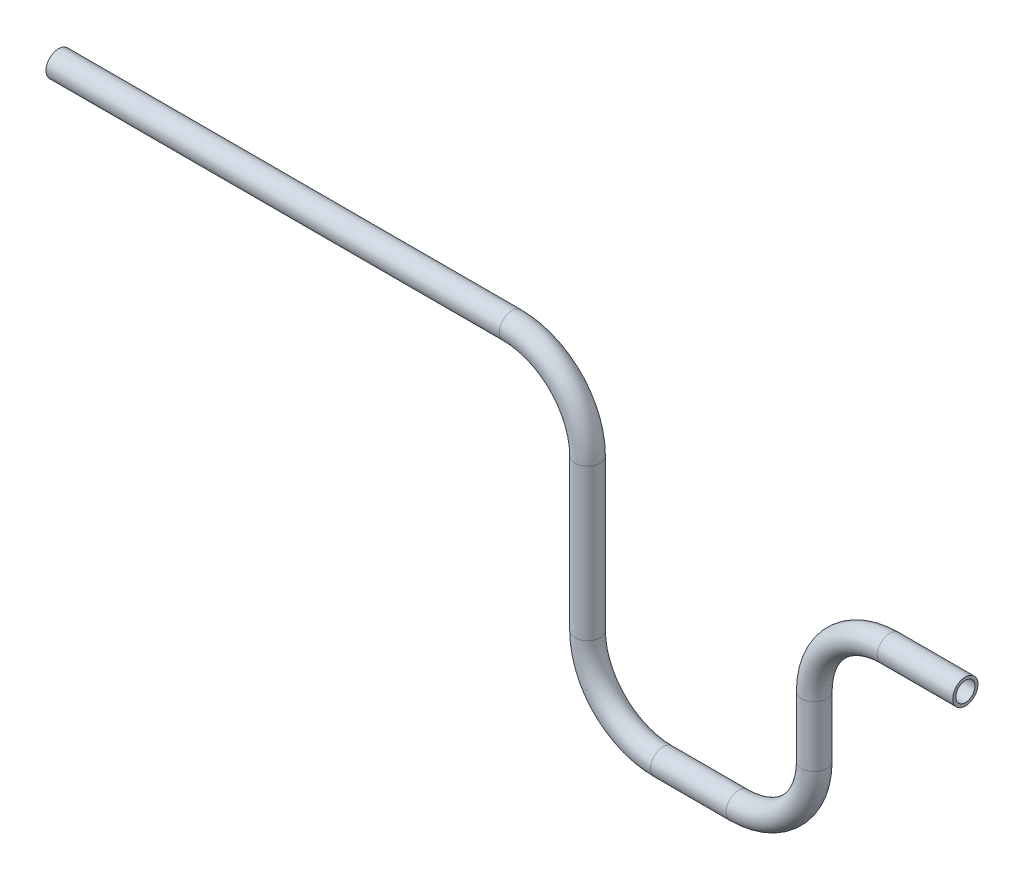
ISO-10303-21;
HEADER;
FILE_DESCRIPTION(('STEP AP214'),'2;1');
FILE_NAME('part.step','',(''),(''),'','','');
FILE_SCHEMA(('AUTOMOTIVE_DESIGN { 1 0 10303 214 1 1 1 1 }'));
ENDSEC;
DATA;
#1=APPLICATION_CONTEXT('core data for automotive mechanical design processes');
#2=APPLICATION_PROTOCOL_DEFINITION('international standard','automotive_design',2000,#1);
#3=PRODUCT_CONTEXT('',#1,'mechanical');
#4=PRODUCT('Part','Part','',(#3));
#5=PRODUCT_RELATED_PRODUCT_CATEGORY('part','',(#4));
#6=PRODUCT_DEFINITION_FORMATION('','',#4);
#7=PRODUCT_DEFINITION_CONTEXT('part definition',#1,'design');
#8=PRODUCT_DEFINITION('design','',#6,#7);
#9=PRODUCT_DEFINITION_SHAPE('','',#8);
#10=(LENGTH_UNIT() NAMED_UNIT(*) SI_UNIT(.MILLI.,.METRE.));
#11=(NAMED_UNIT(*) PLANE_ANGLE_UNIT() SI_UNIT($,.RADIAN.));
#12=(NAMED_UNIT(*) SI_UNIT($,.STERADIAN.) SOLID_ANGLE_UNIT());
#13=UNCERTAINTY_MEASURE_WITH_UNIT(LENGTH_MEASURE(1.E-05),#10,'distance_accuracy_value','');
#14=(GEOMETRIC_REPRESENTATION_CONTEXT(3) GLOBAL_UNCERTAINTY_ASSIGNED_CONTEXT((#13)) GLOBAL_UNIT_ASSIGNED_CONTEXT((#10,
#11,#12)) REPRESENTATION_CONTEXT('',''));
#15=CARTESIAN_POINT('',(0.,0.,0.));
#16=DIRECTION('',(0.,0.,1.));
#17=DIRECTION('',(1.,0.,0.));
#18=AXIS2_PLACEMENT_3D('',#15,#16,#17);
#19=CARTESIAN_POINT('',(550.,-59.9999999999998,0.));
#20=DIRECTION('',(1.,0.,0.));
#21=DIRECTION('',(0.,1.,0.));
#22=AXIS2_PLACEMENT_3D('',#19,#20,#21);
#23=CYLINDRICAL_SURFACE('',#22,8.35);
#24=CARTESIAN_POINT('',(550.,-59.9999999999998,0.));
#25=DIRECTION('',(1.,0.,0.));
#26=DIRECTION('',(0.,0.,-1.));
#27=AXIS2_PLACEMENT_3D('',#24,#25,#26);
#28=CIRCLE('',#27,8.35);
#29=CARTESIAN_POINT('',(550.,-51.6499999999999,0.));
#30=VERTEX_POINT('',#29);
#31=EDGE_CURVE('E41',#30,#30,#28,.T.);
#32=ORIENTED_EDGE('',*,*,#31,.T.);
#33=EDGE_LOOP('',(#32));
#34=FACE_BOUND('',#33,.T.);
#35=CARTESIAN_POINT('',(600.,-59.9999999999999,0.));
#36=DIRECTION('',(1.,0.,0.));
#37=DIRECTION('',(0.,0.,-1.));
#38=AXIS2_PLACEMENT_3D('',#35,#36,#37);
#39=CIRCLE('',#38,8.35);
#40=CARTESIAN_POINT('',(600.,-59.9999999999999,-8.35));
#41=VERTEX_POINT('',#40);
#42=EDGE_CURVE('E10',#41,#41,#39,.T.);
#43=ORIENTED_EDGE('',*,*,#42,.F.);
#44=EDGE_LOOP('',(#43));
#45=FACE_BOUND('',#44,.T.);
#46=ADVANCED_FACE('F35',(#34,#45),#23,.T.);
#47=CARTESIAN_POINT('',(550.,-110.,0.));
#48=DIRECTION('',(0.,0.,-1.));
#49=DIRECTION('',(-1.,0.,0.));
#50=AXIS2_PLACEMENT_3D('',#47,#48,#49);
#51=TOROIDAL_SURFACE('',#50,50.0000000000002,8.35);
#52=CARTESIAN_POINT('',(500.,-110.,0.));
#53=DIRECTION('',(0.,1.,0.));
#54=DIRECTION('',(0.,0.,-1.));
#55=AXIS2_PLACEMENT_3D('',#52,#53,#54);
#56=CIRCLE('',#55,8.35);
#57=CARTESIAN_POINT('',(491.65,-110.,0.));
#58=VERTEX_POINT('',#57);
#59=EDGE_CURVE('E45',#58,#58,#56,.T.);
#60=CARTESIAN_POINT('',(550.,-110.,0.));
#61=DIRECTION('',(0.,0.,-1.));
#62=DIRECTION('',(-1.,0.,0.));
#63=AXIS2_PLACEMENT_3D('',#60,#61,#62);
#64=CIRCLE('',#63,58.3500000000002);
#65=EDGE_CURVE('',#58,#30,#64,.T.);
#66=ORIENTED_EDGE('',*,*,#59,.T.);
#67=ORIENTED_EDGE('',*,*,#31,.F.);
#68=ORIENTED_EDGE('',*,*,#65,.T.);
#69=ORIENTED_EDGE('',*,*,#65,.F.);
#70=EDGE_LOOP('',(#66,#68,#67,#69));
#71=FACE_BOUND('',#70,.T.);
#72=ADVANCED_FACE('F127',(#71),#51,.T.);
#73=CARTESIAN_POINT('',(500.,-150.,0.));
#74=DIRECTION('',(0.,1.,0.));
#75=DIRECTION('',(0.,0.,1.));
#76=AXIS2_PLACEMENT_3D('',#73,#74,#75);
#77=CYLINDRICAL_SURFACE('',#76,8.35);
#78=CARTESIAN_POINT('',(500.,-150.,0.));
#79=DIRECTION('',(0.,1.,0.));
#80=DIRECTION('',(0.,0.,-1.));
#81=AXIS2_PLACEMENT_3D('',#78,#79,#80);
#82=CIRCLE('',#81,8.35);
#83=CARTESIAN_POINT('',(508.35,-150.,0.));
#84=VERTEX_POINT('',#83);
#85=EDGE_CURVE('E49',#84,#84,#82,.T.);
#86=ORIENTED_EDGE('',*,*,#85,.T.);
#87=EDGE_LOOP('',(#86));
#88=FACE_BOUND('',#87,.T.);
#89=ORIENTED_EDGE('',*,*,#59,.F.);
#90=EDGE_LOOP('',(#89));
#91=FACE_BOUND('',#90,.T.);
#92=ADVANCED_FACE('F131',(#88,#91),#77,.T.);
#93=CARTESIAN_POINT('',(450.,-150.,0.));
#94=DIRECTION('',(0.,0.,1.));
#95=DIRECTION('',(1.,0.,0.));
#96=AXIS2_PLACEMENT_3D('',#93,#94,#95);
#97=TOROIDAL_SURFACE('',#96,50.,8.35);
#98=CARTESIAN_POINT('',(450.,-200.,0.));
#99=DIRECTION('',(1.,0.,0.));
#100=DIRECTION('',(0.,0.,-1.));
#101=AXIS2_PLACEMENT_3D('',#98,#99,#100);
#102=CIRCLE('',#101,8.35);
#103=CARTESIAN_POINT('',(450.,-208.35,0.));
#104=VERTEX_POINT('',#103);
#105=EDGE_CURVE('E54',#104,#104,#102,.T.);
#106=CARTESIAN_POINT('',(450.,-150.,0.));
#107=DIRECTION('',(0.,0.,1.));
#108=DIRECTION('',(1.,0.,0.));
#109=AXIS2_PLACEMENT_3D('',#106,#107,#108);
#110=CIRCLE('',#109,58.35);
#111=EDGE_CURVE('',#104,#84,#110,.T.);
#112=ORIENTED_EDGE('',*,*,#105,.T.);
#113=ORIENTED_EDGE('',*,*,#85,.F.);
#114=ORIENTED_EDGE('',*,*,#111,.T.);
#115=ORIENTED_EDGE('',*,*,#111,.F.);
#116=EDGE_LOOP('',(#112,#114,#113,#115));
#117=FACE_BOUND('',#116,.T.);
#118=ADVANCED_FACE('F137',(#117),#97,.T.);
#119=CARTESIAN_POINT('',(400.,-200.,0.));
#120=DIRECTION('',(1.,0.,0.));
#121=DIRECTION('',(0.,0.,-1.));
#122=AXIS2_PLACEMENT_3D('',#119,#120,#121);
#123=CYLINDRICAL_SURFACE('',#122,8.35);
#124=CARTESIAN_POINT('',(400.,-200.,0.));
#125=DIRECTION('',(1.,0.,0.));
#126=DIRECTION('',(0.,0.,-1.));
#127=AXIS2_PLACEMENT_3D('',#124,#125,#126);
#128=CIRCLE('',#127,8.35);
#129=CARTESIAN_POINT('',(400.,-208.35,0.));
#130=VERTEX_POINT('',#129);
#131=EDGE_CURVE('E57',#130,#130,#128,.T.);
#132=ORIENTED_EDGE('',*,*,#131,.T.);
#133=EDGE_LOOP('',(#132));
#134=FACE_BOUND('',#133,.T.);
#135=ORIENTED_EDGE('',*,*,#105,.F.);
#136=EDGE_LOOP('',(#135));
#137=FACE_BOUND('',#136,.T.);
#138=ADVANCED_FACE('F144',(#134,#137),#123,.T.);
#139=CARTESIAN_POINT('',(400.,-150.,0.));
#140=DIRECTION('',(0.,0.,1.));
#141=DIRECTION('',(1.,0.,0.));
#142=AXIS2_PLACEMENT_3D('',#139,#140,#141);
#143=TOROIDAL_SURFACE('',#142,50.,8.35);
#144=CARTESIAN_POINT('',(350.,-150.,0.));
#145=DIRECTION('',(0.,-1.,0.));
#146=DIRECTION('',(0.,0.,-1.));
#147=AXIS2_PLACEMENT_3D('',#144,#145,#146);
#148=CIRCLE('',#147,8.35);
#149=CARTESIAN_POINT('',(341.65,-150.,0.));
#150=VERTEX_POINT('',#149);
#151=EDGE_CURVE('E60',#150,#150,#148,.T.);
#152=CARTESIAN_POINT('',(400.,-150.,0.));
#153=DIRECTION('',(0.,0.,1.));
#154=DIRECTION('',(1.,0.,0.));
#155=AXIS2_PLACEMENT_3D('',#152,#153,#154);
#156=CIRCLE('',#155,58.35);
#157=EDGE_CURVE('',#150,#130,#156,.T.);
#158=ORIENTED_EDGE('',*,*,#151,.T.);
#159=ORIENTED_EDGE('',*,*,#131,.F.);
#160=ORIENTED_EDGE('',*,*,#157,.T.);
#161=ORIENTED_EDGE('',*,*,#157,.F.);
#162=EDGE_LOOP('',(#158,#160,#159,#161));
#163=FACE_BOUND('',#162,.T.);
#164=ADVANCED_FACE('F148',(#163),#143,.T.);
#165=CARTESIAN_POINT('',(350.,-50.,0.));
#166=DIRECTION('',(0.,-1.,0.));
#167=DIRECTION('',(0.,0.,-1.));
#168=AXIS2_PLACEMENT_3D('',#165,#166,#167);
#169=CYLINDRICAL_SURFACE('',#168,8.35);
#170=CARTESIAN_POINT('',(350.,-50.,0.));
#171=DIRECTION('',(0.,-1.,0.));
#172=DIRECTION('',(0.,0.,-1.));
#173=AXIS2_PLACEMENT_3D('',#170,#171,#172);
#174=CIRCLE('',#173,8.35);
#175=CARTESIAN_POINT('',(358.35,-50.,0.));
#176=VERTEX_POINT('',#175);
#177=EDGE_CURVE('E63',#176,#176,#174,.T.);
#178=ORIENTED_EDGE('',*,*,#177,.T.);
#179=EDGE_LOOP('',(#178));
#180=FACE_BOUND('',#179,.T.);
#181=ORIENTED_EDGE('',*,*,#151,.F.);
#182=EDGE_LOOP('',(#181));
#183=FACE_BOUND('',#182,.T.);
#184=ADVANCED_FACE('F152',(#180,#183),#169,.T.);
#185=CARTESIAN_POINT('',(300.,-50.,0.));
#186=DIRECTION('',(0.,0.,-1.));
#187=DIRECTION('',(-1.,0.,0.));
#188=AXIS2_PLACEMENT_3D('',#185,#186,#187);
#189=TOROIDAL_SURFACE('',#188,50.,8.35);
#190=CARTESIAN_POINT('',(300.,0.,0.));
#191=DIRECTION('',(1.,0.,0.));
#192=DIRECTION('',(0.,0.,-1.));
#193=AXIS2_PLACEMENT_3D('',#190,#191,#192);
#194=CIRCLE('',#193,8.35);
#195=CARTESIAN_POINT('',(300.,8.35,0.));
#196=VERTEX_POINT('',#195);
#197=EDGE_CURVE('E66',#196,#196,#194,.T.);
#198=CARTESIAN_POINT('',(300.,-50.,0.));
#199=DIRECTION('',(0.,0.,-1.));
#200=DIRECTION('',(-1.,0.,0.));
#201=AXIS2_PLACEMENT_3D('',#198,#199,#200);
#202=CIRCLE('',#201,58.35);
#203=EDGE_CURVE('',#196,#176,#202,.T.);
#204=ORIENTED_EDGE('',*,*,#197,.T.);
#205=ORIENTED_EDGE('',*,*,#177,.F.);
#206=ORIENTED_EDGE('',*,*,#203,.T.);
#207=ORIENTED_EDGE('',*,*,#203,.F.);
#208=EDGE_LOOP('',(#204,#206,#205,#207));
#209=FACE_BOUND('',#208,.T.);
#210=ADVANCED_FACE('F122',(#209),#189,.T.);
#211=CARTESIAN_POINT('',(300.,0.,0.));
#212=DIRECTION('',(-1.,0.,0.));
#213=DIRECTION('',(0.,0.,1.));
#214=AXIS2_PLACEMENT_3D('',#211,#212,#213);
#215=CYLINDRICAL_SURFACE('',#214,8.35);
#216=ORIENTED_EDGE('',*,*,#197,.F.);
#217=EDGE_LOOP('',(#216));
#218=FACE_BOUND('',#217,.T.);
#219=CARTESIAN_POINT('',(0.,0.,0.));
#220=DIRECTION('',(1.,0.,0.));
#221=DIRECTION('',(0.,0.,-1.));
#222=AXIS2_PLACEMENT_3D('',#219,#220,#221);
#223=CIRCLE('',#222,8.35);
#224=CARTESIAN_POINT('',(0.,0.,-8.35));
#225=VERTEX_POINT('',#224);
#226=EDGE_CURVE('E67',#225,#225,#223,.T.);
#227=ORIENTED_EDGE('',*,*,#226,.T.);
#228=EDGE_LOOP('',(#227));
#229=FACE_BOUND('',#228,.T.);
#230=ADVANCED_FACE('F114',(#218,#229),#215,.T.);
#231=CARTESIAN_POINT('',(600.,-59.9999999999999,0.));
#232=DIRECTION('',(1.,0.,0.));
#233=DIRECTION('',(0.,0.,-1.));
#234=AXIS2_PLACEMENT_3D('',#231,#232,#233);
#235=PLANE('',#234);
#236=CARTESIAN_POINT('',(600.,-59.9999999999999,0.));
#237=DIRECTION('',(1.,0.,0.));
#238=DIRECTION('',(0.,0.,-1.));
#239=AXIS2_PLACEMENT_3D('',#236,#237,#238);
#240=CIRCLE('',#239,6.35);
#241=CARTESIAN_POINT('',(600.,-59.9999999999999,-6.35));
#242=VERTEX_POINT('',#241);
#243=EDGE_CURVE('E70',#242,#242,#240,.T.);
#244=ORIENTED_EDGE('',*,*,#243,.F.);
#245=EDGE_LOOP('',(#244));
#246=FACE_BOUND('',#245,.T.);
#247=ORIENTED_EDGE('',*,*,#42,.T.);
#248=EDGE_LOOP('',(#247));
#249=FACE_BOUND('',#248,.T.);
#250=ADVANCED_FACE('F112',(#246,#249),#235,.T.);
#251=CARTESIAN_POINT('',(0.,0.,0.));
#252=DIRECTION('',(1.,0.,0.));
#253=DIRECTION('',(0.,0.,-1.));
#254=AXIS2_PLACEMENT_3D('',#251,#252,#253);
#255=PLANE('',#254);
#256=CARTESIAN_POINT('',(0.,0.,0.));
#257=DIRECTION('',(1.,0.,0.));
#258=DIRECTION('',(0.,0.,-1.));
#259=AXIS2_PLACEMENT_3D('',#256,#257,#258);
#260=CIRCLE('',#259,6.35);
#261=CARTESIAN_POINT('',(0.,0.,-6.35));
#262=VERTEX_POINT('',#261);
#263=EDGE_CURVE('E73',#262,#262,#260,.T.);
#264=ORIENTED_EDGE('',*,*,#263,.T.);
#265=EDGE_LOOP('',(#264));
#266=FACE_BOUND('',#265,.T.);
#267=ORIENTED_EDGE('',*,*,#226,.F.);
#268=EDGE_LOOP('',(#267));
#269=FACE_BOUND('',#268,.T.);
#270=ADVANCED_FACE('F108',(#266,#269),#255,.F.);
#271=CARTESIAN_POINT('',(550.,-59.9999999999998,0.));
#272=DIRECTION('',(1.,0.,0.));
#273=DIRECTION('',(0.,1.,0.));
#274=AXIS2_PLACEMENT_3D('',#271,#272,#273);
#275=CYLINDRICAL_SURFACE('',#274,6.35);
#276=CARTESIAN_POINT('',(550.,-59.9999999999998,0.));
#277=DIRECTION('',(1.,0.,0.));
#278=DIRECTION('',(0.,1.,0.));
#279=AXIS2_PLACEMENT_3D('',#276,#277,#278);
#280=CIRCLE('',#279,6.35);
#281=CARTESIAN_POINT('',(550.,-53.6499999999999,0.));
#282=VERTEX_POINT('',#281);
#283=EDGE_CURVE('E79',#282,#282,#280,.T.);
#284=ORIENTED_EDGE('',*,*,#283,.F.);
#285=EDGE_LOOP('',(#284));
#286=FACE_BOUND('',#285,.T.);
#287=ORIENTED_EDGE('',*,*,#243,.T.);
#288=EDGE_LOOP('',(#287));
#289=FACE_BOUND('',#288,.T.);
#290=ADVANCED_FACE('F105',(#286,#289),#275,.F.);
#291=CARTESIAN_POINT('',(550.,-110.,0.));
#292=DIRECTION('',(0.,0.,-1.));
#293=DIRECTION('',(-1.,0.,0.));
#294=AXIS2_PLACEMENT_3D('',#291,#292,#293);
#295=TOROIDAL_SURFACE('',#294,50.0000000000002,6.35);
#296=CARTESIAN_POINT('',(500.,-110.,0.));
#297=DIRECTION('',(0.,-1.,0.));
#298=DIRECTION('',(1.,0.,0.));
#299=AXIS2_PLACEMENT_3D('',#296,#297,#298);
#300=CIRCLE('',#299,6.35);
#301=CARTESIAN_POINT('',(493.65,-110.,0.));
#302=VERTEX_POINT('',#301);
#303=EDGE_CURVE('E97',#302,#302,#300,.F.);
#304=CARTESIAN_POINT('',(550.,-110.,0.));
#305=DIRECTION('',(0.,0.,-1.));
#306=DIRECTION('',(-1.,0.,0.));
#307=AXIS2_PLACEMENT_3D('',#304,#305,#306);
#308=CIRCLE('',#307,56.3500000000002);
#309=EDGE_CURVE('',#302,#282,#308,.T.);
#310=ORIENTED_EDGE('',*,*,#303,.F.);
#311=ORIENTED_EDGE('',*,*,#283,.T.);
#312=ORIENTED_EDGE('',*,*,#309,.T.);
#313=ORIENTED_EDGE('',*,*,#309,.F.);
#314=EDGE_LOOP('',(#310,#312,#311,#313));
#315=FACE_BOUND('',#314,.T.);
#316=ADVANCED_FACE('F103',(#315),#295,.F.);
#317=CARTESIAN_POINT('',(500.,-150.,0.));
#318=DIRECTION('',(0.,1.,0.));
#319=DIRECTION('',(0.,0.,1.));
#320=AXIS2_PLACEMENT_3D('',#317,#318,#319);
#321=CYLINDRICAL_SURFACE('',#320,6.35);
#322=CARTESIAN_POINT('',(500.,-150.,0.));
#323=DIRECTION('',(0.,1.,0.));
#324=DIRECTION('',(0.,0.,1.));
#325=AXIS2_PLACEMENT_3D('',#322,#323,#324);
#326=CIRCLE('',#325,6.35);
#327=CARTESIAN_POINT('',(506.35,-150.,0.));
#328=VERTEX_POINT('',#327);
#329=EDGE_CURVE('E94',#328,#328,#326,.T.);
#330=ORIENTED_EDGE('',*,*,#329,.F.);
#331=EDGE_LOOP('',(#330));
#332=FACE_BOUND('',#331,.T.);
#333=ORIENTED_EDGE('',*,*,#303,.T.);
#334=EDGE_LOOP('',(#333));
#335=FACE_BOUND('',#334,.T.);
#336=ADVANCED_FACE('F208',(#332,#335),#321,.F.);
#337=CARTESIAN_POINT('',(450.,-150.,0.));
#338=DIRECTION('',(0.,0.,1.));
#339=DIRECTION('',(1.,0.,0.));
#340=AXIS2_PLACEMENT_3D('',#337,#338,#339);
#341=TOROIDAL_SURFACE('',#340,50.,6.35);
#342=CARTESIAN_POINT('',(450.,-200.,0.));
#343=DIRECTION('',(-1.,0.,0.));
#344=DIRECTION('',(0.,-1.,0.));
#345=AXIS2_PLACEMENT_3D('',#342,#343,#344);
#346=CIRCLE('',#345,6.35);
#347=CARTESIAN_POINT('',(450.,-206.35,0.));
#348=VERTEX_POINT('',#347);
#349=EDGE_CURVE('E91',#348,#348,#346,.F.);
#350=CARTESIAN_POINT('',(450.,-150.,0.));
#351=DIRECTION('',(0.,0.,1.));
#352=DIRECTION('',(1.,0.,0.));
#353=AXIS2_PLACEMENT_3D('',#350,#351,#352);
#354=CIRCLE('',#353,56.35);
#355=EDGE_CURVE('',#348,#328,#354,.T.);
#356=ORIENTED_EDGE('',*,*,#349,.F.);
#357=ORIENTED_EDGE('',*,*,#329,.T.);
#358=ORIENTED_EDGE('',*,*,#355,.T.);
#359=ORIENTED_EDGE('',*,*,#355,.F.);
#360=EDGE_LOOP('',(#356,#358,#357,#359));
#361=FACE_BOUND('',#360,.T.);
#362=ADVANCED_FACE('F218',(#361),#341,.F.);
#363=CARTESIAN_POINT('',(400.,-200.,0.));
#364=DIRECTION('',(1.,0.,0.));
#365=DIRECTION('',(0.,0.,-1.));
#366=AXIS2_PLACEMENT_3D('',#363,#364,#365);
#367=CYLINDRICAL_SURFACE('',#366,6.35);
#368=CARTESIAN_POINT('',(400.,-200.,0.));
#369=DIRECTION('',(1.,0.,0.));
#370=DIRECTION('',(0.,0.,-1.));
#371=AXIS2_PLACEMENT_3D('',#368,#369,#370);
#372=CIRCLE('',#371,6.35);
#373=CARTESIAN_POINT('',(400.,-206.35,0.));
#374=VERTEX_POINT('',#373);
#375=EDGE_CURVE('E88',#374,#374,#372,.T.);
#376=ORIENTED_EDGE('',*,*,#375,.F.);
#377=EDGE_LOOP('',(#376));
#378=FACE_BOUND('',#377,.T.);
#379=ORIENTED_EDGE('',*,*,#349,.T.);
#380=EDGE_LOOP('',(#379));
#381=FACE_BOUND('',#380,.T.);
#382=ADVANCED_FACE('F228',(#378,#381),#367,.F.);
#383=CARTESIAN_POINT('',(400.,-150.,0.));
#384=DIRECTION('',(0.,0.,1.));
#385=DIRECTION('',(1.,0.,0.));
#386=AXIS2_PLACEMENT_3D('',#383,#384,#385);
#387=TOROIDAL_SURFACE('',#386,50.,6.35);
#388=CARTESIAN_POINT('',(350.,-150.,0.));
#389=DIRECTION('',(0.,1.,0.));
#390=DIRECTION('',(-1.,0.,0.));
#391=AXIS2_PLACEMENT_3D('',#388,#389,#390);
#392=CIRCLE('',#391,6.35);
#393=CARTESIAN_POINT('',(343.65,-150.,0.));
#394=VERTEX_POINT('',#393);
#395=EDGE_CURVE('E85',#394,#394,#392,.F.);
#396=CARTESIAN_POINT('',(400.,-150.,0.));
#397=DIRECTION('',(0.,0.,1.));
#398=DIRECTION('',(1.,0.,0.));
#399=AXIS2_PLACEMENT_3D('',#396,#397,#398);
#400=CIRCLE('',#399,56.35);
#401=EDGE_CURVE('',#394,#374,#400,.T.);
#402=ORIENTED_EDGE('',*,*,#395,.F.);
#403=ORIENTED_EDGE('',*,*,#375,.T.);
#404=ORIENTED_EDGE('',*,*,#401,.T.);
#405=ORIENTED_EDGE('',*,*,#401,.F.);
#406=EDGE_LOOP('',(#402,#404,#403,#405));
#407=FACE_BOUND('',#406,.T.);
#408=ADVANCED_FACE('F238',(#407),#387,.F.);
#409=CARTESIAN_POINT('',(350.,-50.,0.));
#410=DIRECTION('',(0.,-1.,0.));
#411=DIRECTION('',(0.,0.,-1.));
#412=AXIS2_PLACEMENT_3D('',#409,#410,#411);
#413=CYLINDRICAL_SURFACE('',#412,6.35);
#414=CARTESIAN_POINT('',(350.,-50.,0.));
#415=DIRECTION('',(0.,-1.,0.));
#416=DIRECTION('',(0.,0.,-1.));
#417=AXIS2_PLACEMENT_3D('',#414,#415,#416);
#418=CIRCLE('',#417,6.35);
#419=CARTESIAN_POINT('',(356.35,-50.,0.));
#420=VERTEX_POINT('',#419);
#421=EDGE_CURVE('E82',#420,#420,#418,.T.);
#422=ORIENTED_EDGE('',*,*,#421,.F.);
#423=EDGE_LOOP('',(#422));
#424=FACE_BOUND('',#423,.T.);
#425=ORIENTED_EDGE('',*,*,#395,.T.);
#426=EDGE_LOOP('',(#425));
#427=FACE_BOUND('',#426,.T.);
#428=ADVANCED_FACE('F248',(#424,#427),#413,.F.);
#429=CARTESIAN_POINT('',(300.,-50.,0.));
#430=DIRECTION('',(0.,0.,-1.));
#431=DIRECTION('',(-1.,0.,0.));
#432=AXIS2_PLACEMENT_3D('',#429,#430,#431);
#433=TOROIDAL_SURFACE('',#432,50.,6.35);
#434=CARTESIAN_POINT('',(300.,0.,0.));
#435=DIRECTION('',(-1.,0.,0.));
#436=DIRECTION('',(0.,-1.,0.));
#437=AXIS2_PLACEMENT_3D('',#434,#435,#436);
#438=CIRCLE('',#437,6.35);
#439=CARTESIAN_POINT('',(300.,6.35,0.));
#440=VERTEX_POINT('',#439);
#441=EDGE_CURVE('E76',#440,#440,#438,.F.);
#442=CARTESIAN_POINT('',(300.,-50.,0.));
#443=DIRECTION('',(0.,0.,-1.));
#444=DIRECTION('',(-1.,0.,0.));
#445=AXIS2_PLACEMENT_3D('',#442,#443,#444);
#446=CIRCLE('',#445,56.35);
#447=EDGE_CURVE('',#440,#420,#446,.T.);
#448=ORIENTED_EDGE('',*,*,#441,.F.);
#449=ORIENTED_EDGE('',*,*,#421,.T.);
#450=ORIENTED_EDGE('',*,*,#447,.T.);
#451=ORIENTED_EDGE('',*,*,#447,.F.);
#452=EDGE_LOOP('',(#448,#450,#449,#451));
#453=FACE_BOUND('',#452,.T.);
#454=ADVANCED_FACE('F258',(#453),#433,.F.);
#455=CARTESIAN_POINT('',(300.,0.,0.));
#456=DIRECTION('',(-1.,0.,0.));
#457=DIRECTION('',(0.,0.,1.));
#458=AXIS2_PLACEMENT_3D('',#455,#456,#457);
#459=CYLINDRICAL_SURFACE('',#458,6.35);
#460=ORIENTED_EDGE('',*,*,#441,.T.);
#461=EDGE_LOOP('',(#460));
#462=FACE_BOUND('',#461,.T.);
#463=ORIENTED_EDGE('',*,*,#263,.F.);
#464=EDGE_LOOP('',(#463));
#465=FACE_BOUND('',#464,.T.);
#466=ADVANCED_FACE('F268',(#462,#465),#459,.F.);
#467=CLOSED_SHELL('',(#46,#72,#92,#118,#138,#164,#184,#210,#230,#250,#270,#290,#316,#336,#362,
#382,#408,#428,#454,#466));
#468=MANIFOLD_SOLID_BREP('B2',#467);
#469=ADVANCED_BREP_SHAPE_REPRESENTATION('',(#18,#468),#14);
#470=SHAPE_DEFINITION_REPRESENTATION(#9,#469);
ENDSEC;
END-ISO-10303-21;
